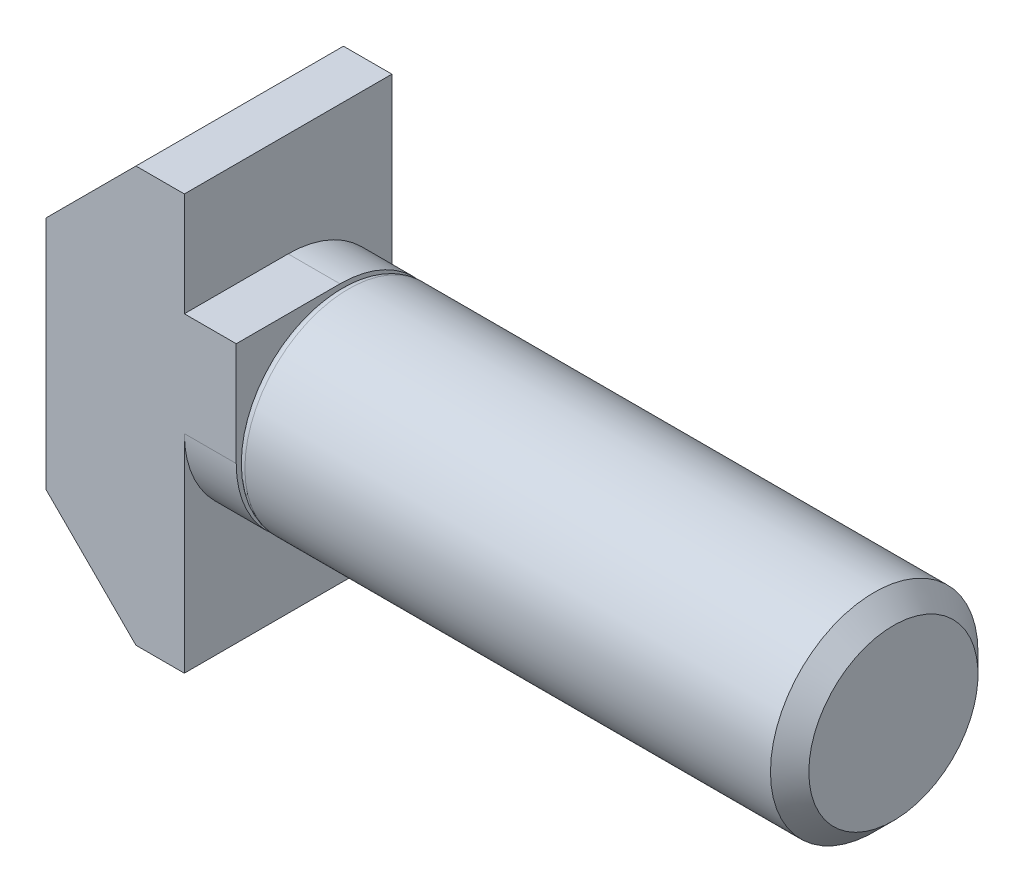
ISO-10303-21;
HEADER;
FILE_DESCRIPTION(('STEP AP214'),'2;1');
FILE_NAME('part.step','',(''),(''),'','','');
FILE_SCHEMA(('AUTOMOTIVE_DESIGN { 1 0 10303 214 1 1 1 1 }'));
ENDSEC;
DATA;
#1=APPLICATION_CONTEXT('core data for automotive mechanical design processes');
#2=APPLICATION_PROTOCOL_DEFINITION('international standard','automotive_design',2000,#1);
#3=PRODUCT_CONTEXT('',#1,'mechanical');
#4=PRODUCT('Part','Part','',(#3));
#5=PRODUCT_RELATED_PRODUCT_CATEGORY('part','',(#4));
#6=PRODUCT_DEFINITION_FORMATION('','',#4);
#7=PRODUCT_DEFINITION_CONTEXT('part definition',#1,'design');
#8=PRODUCT_DEFINITION('design','',#6,#7);
#9=PRODUCT_DEFINITION_SHAPE('','',#8);
#10=(LENGTH_UNIT() NAMED_UNIT(*) SI_UNIT(.MILLI.,.METRE.));
#11=(NAMED_UNIT(*) PLANE_ANGLE_UNIT() SI_UNIT($,.RADIAN.));
#12=(NAMED_UNIT(*) SI_UNIT($,.STERADIAN.) SOLID_ANGLE_UNIT());
#13=UNCERTAINTY_MEASURE_WITH_UNIT(LENGTH_MEASURE(1.E-05),#10,'distance_accuracy_value','');
#14=(GEOMETRIC_REPRESENTATION_CONTEXT(3) GLOBAL_UNCERTAINTY_ASSIGNED_CONTEXT((#13)) GLOBAL_UNIT_ASSIGNED_CONTEXT((#10,
#11,#12)) REPRESENTATION_CONTEXT('',''));
#15=CARTESIAN_POINT('',(0.,0.,0.));
#16=DIRECTION('',(0.,0.,1.));
#17=DIRECTION('',(1.,0.,0.));
#18=AXIS2_PLACEMENT_3D('',#15,#16,#17);
#19=CARTESIAN_POINT('',(-31.75,0.,0.));
#20=DIRECTION('',(-1.,0.,0.));
#21=DIRECTION('',(0.,0.,1.));
#22=AXIS2_PLACEMENT_3D('',#19,#20,#21);
#23=CYLINDRICAL_SURFACE('',#22,2.99999999999984);
#24=CARTESIAN_POINT('',(0.25,0.,0.));
#25=DIRECTION('',(-1.,0.,0.));
#26=DIRECTION('',(0.,0.,1.));
#27=AXIS2_PLACEMENT_3D('',#24,#25,#26);
#28=CIRCLE('',#27,2.99999999999984);
#29=CARTESIAN_POINT('',(0.25,0.,2.99999999999984));
#30=VERTEX_POINT('',#29);
#31=EDGE_CURVE('E167',#30,#30,#28,.F.);
#32=ORIENTED_EDGE('',*,*,#31,.T.);
#33=EDGE_LOOP('',(#32));
#34=FACE_BOUND('',#33,.T.);
#35=CARTESIAN_POINT('',(15.4454999999998,0.,0.));
#36=DIRECTION('',(-1.,0.,0.));
#37=DIRECTION('',(0.,0.,1.));
#38=AXIS2_PLACEMENT_3D('',#35,#36,#37);
#39=CIRCLE('',#38,2.99999999999982);
#40=CARTESIAN_POINT('',(15.4454999999998,0.,2.99999999999982));
#41=VERTEX_POINT('',#40);
#42=EDGE_CURVE('E153',#41,#41,#39,.T.);
#43=ORIENTED_EDGE('',*,*,#42,.T.);
#44=EDGE_LOOP('',(#43));
#45=FACE_BOUND('',#44,.T.);
#46=ADVANCED_FACE('F36',(#34,#45),#23,.T.);
#47=CARTESIAN_POINT('',(16.,0.,0.));
#48=DIRECTION('',(-1.,0.,0.));
#49=DIRECTION('',(0.,0.,1.));
#50=AXIS2_PLACEMENT_3D('',#47,#48,#49);
#51=CONICAL_SURFACE('',#50,2.4455,0.785398163397136);
#52=ORIENTED_EDGE('',*,*,#42,.F.);
#53=EDGE_LOOP('',(#52));
#54=FACE_BOUND('',#53,.T.);
#55=CARTESIAN_POINT('',(16.,0.,0.));
#56=DIRECTION('',(-1.,0.,0.));
#57=DIRECTION('',(0.,0.,1.));
#58=AXIS2_PLACEMENT_3D('',#55,#56,#57);
#59=CIRCLE('',#58,2.4455);
#60=CARTESIAN_POINT('',(16.,0.,2.4455));
#61=VERTEX_POINT('',#60);
#62=EDGE_CURVE('E149',#61,#61,#59,.T.);
#63=ORIENTED_EDGE('',*,*,#62,.T.);
#64=EDGE_LOOP('',(#63));
#65=FACE_BOUND('',#64,.T.);
#66=ADVANCED_FACE('F285',(#54,#65),#51,.T.);
#67=CARTESIAN_POINT('',(16.,2.4455,0.));
#68=DIRECTION('',(1.,0.,0.));
#69=DIRECTION('',(0.,0.,-1.));
#70=AXIS2_PLACEMENT_3D('',#67,#68,#69);
#71=PLANE('',#70);
#72=ORIENTED_EDGE('',*,*,#62,.F.);
#73=EDGE_LOOP('',(#72));
#74=FACE_BOUND('',#73,.T.);
#75=ADVANCED_FACE('F291',(#74),#71,.T.);
#76=CARTESIAN_POINT('',(0.25,0.,0.));
#77=DIRECTION('',(-1.,0.,0.));
#78=DIRECTION('',(0.,0.,1.));
#79=AXIS2_PLACEMENT_3D('',#76,#77,#78);
#80=TOROIDAL_SURFACE('',#79,2.74999999999984,0.25);
#81=ORIENTED_EDGE('',*,*,#31,.F.);
#82=EDGE_LOOP('',(#81));
#83=FACE_BOUND('',#82,.T.);
#84=CARTESIAN_POINT('',(0.,0.,0.));
#85=DIRECTION('',(-1.,0.,0.));
#86=DIRECTION('',(0.,0.,1.));
#87=AXIS2_PLACEMENT_3D('',#84,#85,#86);
#88=CIRCLE('',#87,2.74999999999984);
#89=CARTESIAN_POINT('',(0.,0.,2.74999999999984));
#90=VERTEX_POINT('',#89);
#91=EDGE_CURVE('E163',#90,#90,#88,.T.);
#92=ORIENTED_EDGE('',*,*,#91,.F.);
#93=EDGE_LOOP('',(#92));
#94=FACE_BOUND('',#93,.T.);
#95=ADVANCED_FACE('F297',(#83,#94),#80,.T.);
#96=CARTESIAN_POINT('',(-5.5,3.4,3.));
#97=DIRECTION('',(0.707106781186548,-0.707106781186547,0.));
#98=DIRECTION('',(0.707106781186547,0.707106781186548,0.));
#99=AXIS2_PLACEMENT_3D('',#96,#97,#98);
#100=PLANE('',#99);
#101=DIRECTION('',(-0.707106781186547,-0.707106781186548,0.));
#102=VECTOR('',#101,1.);
#103=CARTESIAN_POINT('',(-5.5,3.4,-3.));
#104=LINE('',#103,#102);
#105=CARTESIAN_POINT('',(-2.9,6.,-3.));
#106=VERTEX_POINT('',#105);
#107=CARTESIAN_POINT('',(-5.5,3.4,-3.));
#108=VERTEX_POINT('',#107);
#109=EDGE_CURVE('E148',#106,#108,#104,.T.);
#110=ORIENTED_EDGE('',*,*,#109,.T.);
#111=DIRECTION('',(0.,0.,-1.));
#112=VECTOR('',#111,1.);
#113=CARTESIAN_POINT('',(-5.5,3.4,3.));
#114=LINE('',#113,#112);
#115=CARTESIAN_POINT('',(-5.5,3.4,3.));
#116=VERTEX_POINT('',#115);
#117=EDGE_CURVE('E128',#116,#108,#114,.T.);
#118=ORIENTED_EDGE('',*,*,#117,.F.);
#119=DIRECTION('',(-0.707106781186547,-0.707106781186548,0.));
#120=VECTOR('',#119,1.);
#121=CARTESIAN_POINT('',(-5.5,3.4,3.));
#122=LINE('',#121,#120);
#123=CARTESIAN_POINT('',(-2.9,6.,3.));
#124=VERTEX_POINT('',#123);
#125=EDGE_CURVE('E135',#124,#116,#122,.T.);
#126=ORIENTED_EDGE('',*,*,#125,.F.);
#127=DIRECTION('',(0.,0.,-1.));
#128=VECTOR('',#127,1.);
#129=CARTESIAN_POINT('',(-2.9,6.,3.));
#130=LINE('',#129,#128);
#131=EDGE_CURVE('E217',#124,#106,#130,.T.);
#132=ORIENTED_EDGE('',*,*,#131,.T.);
#133=EDGE_LOOP('',(#110,#118,#126,#132));
#134=FACE_BOUND('',#133,.T.);
#135=ADVANCED_FACE('F146',(#134),#100,.F.);
#136=CARTESIAN_POINT('',(-5.5,-3.4,3.));
#137=DIRECTION('',(1.,0.,0.));
#138=DIRECTION('',(0.,0.,-1.));
#139=AXIS2_PLACEMENT_3D('',#136,#137,#138);
#140=PLANE('',#139);
#141=DIRECTION('',(0.,-1.,0.));
#142=VECTOR('',#141,1.);
#143=CARTESIAN_POINT('',(-5.5,-3.4,-3.));
#144=LINE('',#143,#142);
#145=CARTESIAN_POINT('',(-5.5,-3.4,-3.));
#146=VERTEX_POINT('',#145);
#147=EDGE_CURVE('E219',#108,#146,#144,.T.);
#148=ORIENTED_EDGE('',*,*,#147,.T.);
#149=DIRECTION('',(0.,0.,-1.));
#150=VECTOR('',#149,1.);
#151=CARTESIAN_POINT('',(-5.5,-3.4,3.));
#152=LINE('',#151,#150);
#153=CARTESIAN_POINT('',(-5.5,-3.4,3.));
#154=VERTEX_POINT('',#153);
#155=EDGE_CURVE('E131',#154,#146,#152,.T.);
#156=ORIENTED_EDGE('',*,*,#155,.F.);
#157=DIRECTION('',(0.,-1.,0.));
#158=VECTOR('',#157,1.);
#159=CARTESIAN_POINT('',(-5.5,-3.4,3.));
#160=LINE('',#159,#158);
#161=EDGE_CURVE('E124',#116,#154,#160,.T.);
#162=ORIENTED_EDGE('',*,*,#161,.F.);
#163=ORIENTED_EDGE('',*,*,#117,.T.);
#164=EDGE_LOOP('',(#148,#156,#162,#163));
#165=FACE_BOUND('',#164,.T.);
#166=ADVANCED_FACE('F126',(#165),#140,.F.);
#167=CARTESIAN_POINT('',(-5.5,-3.4,3.));
#168=DIRECTION('',(0.707106781186548,0.707106781186547,0.));
#169=DIRECTION('',(-0.707106781186547,0.707106781186548,0.));
#170=AXIS2_PLACEMENT_3D('',#167,#168,#169);
#171=PLANE('',#170);
#172=DIRECTION('',(0.707106781186547,-0.707106781186548,0.));
#173=VECTOR('',#172,1.);
#174=CARTESIAN_POINT('',(-5.5,-3.4,-3.));
#175=LINE('',#174,#173);
#176=CARTESIAN_POINT('',(-2.9,-6.,-3.));
#177=VERTEX_POINT('',#176);
#178=EDGE_CURVE('E221',#146,#177,#175,.T.);
#179=ORIENTED_EDGE('',*,*,#178,.T.);
#180=DIRECTION('',(0.,0.,-1.));
#181=VECTOR('',#180,1.);
#182=CARTESIAN_POINT('',(-2.9,-6.,3.));
#183=LINE('',#182,#181);
#184=CARTESIAN_POINT('',(-2.9,-6.,3.));
#185=VERTEX_POINT('',#184);
#186=EDGE_CURVE('E156',#185,#177,#183,.T.);
#187=ORIENTED_EDGE('',*,*,#186,.F.);
#188=DIRECTION('',(0.707106781186547,-0.707106781186548,0.));
#189=VECTOR('',#188,1.);
#190=CARTESIAN_POINT('',(-5.5,-3.4,3.));
#191=LINE('',#190,#189);
#192=EDGE_CURVE('E134',#154,#185,#191,.T.);
#193=ORIENTED_EDGE('',*,*,#192,.F.);
#194=ORIENTED_EDGE('',*,*,#155,.T.);
#195=EDGE_LOOP('',(#179,#187,#193,#194));
#196=FACE_BOUND('',#195,.T.);
#197=ADVANCED_FACE('F274',(#196),#171,.F.);
#198=CARTESIAN_POINT('',(-2.9,-6.,3.));
#199=DIRECTION('',(0.,1.,0.));
#200=DIRECTION('',(0.,0.,1.));
#201=AXIS2_PLACEMENT_3D('',#198,#199,#200);
#202=PLANE('',#201);
#203=DIRECTION('',(1.,0.,0.));
#204=VECTOR('',#203,1.);
#205=CARTESIAN_POINT('',(-2.9,-6.,-3.));
#206=LINE('',#205,#204);
#207=CARTESIAN_POINT('',(-1.5,-6.,-3.));
#208=VERTEX_POINT('',#207);
#209=EDGE_CURVE('E223',#177,#208,#206,.T.);
#210=ORIENTED_EDGE('',*,*,#209,.T.);
#211=DIRECTION('',(0.,0.,-1.));
#212=VECTOR('',#211,1.);
#213=CARTESIAN_POINT('',(-1.5,-6.,3.));
#214=LINE('',#213,#212);
#215=CARTESIAN_POINT('',(-1.5,-6.,3.));
#216=VERTEX_POINT('',#215);
#217=EDGE_CURVE('E248',#216,#208,#214,.T.);
#218=ORIENTED_EDGE('',*,*,#217,.F.);
#219=DIRECTION('',(1.,0.,0.));
#220=VECTOR('',#219,1.);
#221=CARTESIAN_POINT('',(-2.9,-6.,3.));
#222=LINE('',#221,#220);
#223=EDGE_CURVE('E211',#185,#216,#222,.T.);
#224=ORIENTED_EDGE('',*,*,#223,.F.);
#225=ORIENTED_EDGE('',*,*,#186,.T.);
#226=EDGE_LOOP('',(#210,#218,#224,#225));
#227=FACE_BOUND('',#226,.T.);
#228=ADVANCED_FACE('F254',(#227),#202,.F.);
#229=CARTESIAN_POINT('',(-1.5,-6.,3.));
#230=DIRECTION('',(-1.,0.,0.));
#231=DIRECTION('',(0.,-1.,0.));
#232=AXIS2_PLACEMENT_3D('',#229,#230,#231);
#233=PLANE('',#232);
#234=DIRECTION('',(0.,1.,0.));
#235=VECTOR('',#234,1.);
#236=CARTESIAN_POINT('',(-1.5,-6.,-3.));
#237=LINE('',#236,#235);
#238=CARTESIAN_POINT('',(-1.5,-3.,-3.));
#239=VERTEX_POINT('',#238);
#240=EDGE_CURVE('E225',#208,#239,#237,.T.);
#241=ORIENTED_EDGE('',*,*,#240,.T.);
#242=DIRECTION('',(0.,0.,-1.));
#243=VECTOR('',#242,1.);
#244=CARTESIAN_POINT('',(-1.5,-3.,3.));
#245=LINE('',#244,#243);
#246=CARTESIAN_POINT('',(-1.5,-3.,0.));
#247=VERTEX_POINT('',#246);
#248=EDGE_CURVE('E193',#247,#239,#245,.T.);
#249=ORIENTED_EDGE('',*,*,#248,.F.);
#250=CARTESIAN_POINT('',(-1.5,0.,0.));
#251=DIRECTION('',(-1.,0.,0.));
#252=DIRECTION('',(0.,-1.,0.));
#253=AXIS2_PLACEMENT_3D('',#250,#251,#252);
#254=CIRCLE('',#253,3.);
#255=CARTESIAN_POINT('',(-1.5,0.,3.));
#256=VERTEX_POINT('',#255);
#257=EDGE_CURVE('E44',#247,#256,#254,.T.);
#258=ORIENTED_EDGE('',*,*,#257,.T.);
#259=DIRECTION('',(0.,1.,0.));
#260=VECTOR('',#259,1.);
#261=CARTESIAN_POINT('',(-1.5,-6.,3.));
#262=LINE('',#261,#260);
#263=EDGE_CURVE('E192',#216,#256,#262,.T.);
#264=ORIENTED_EDGE('',*,*,#263,.F.);
#265=ORIENTED_EDGE('',*,*,#217,.T.);
#266=EDGE_LOOP('',(#241,#249,#258,#264,#265));
#267=FACE_BOUND('',#266,.T.);
#268=ADVANCED_FACE('F190',(#267),#233,.F.);
#269=CARTESIAN_POINT('',(-1.5,-3.,3.));
#270=DIRECTION('',(0.,1.,0.));
#271=DIRECTION('',(-1.,0.,0.));
#272=AXIS2_PLACEMENT_3D('',#269,#270,#271);
#273=PLANE('',#272);
#274=DIRECTION('',(0.,0.,-1.));
#275=VECTOR('',#274,1.);
#276=CARTESIAN_POINT('',(0.,-3.,3.));
#277=LINE('',#276,#275);
#278=CARTESIAN_POINT('',(0.,-3.,0.));
#279=VERTEX_POINT('',#278);
#280=CARTESIAN_POINT('',(0.,-3.,-3.));
#281=VERTEX_POINT('',#280);
#282=EDGE_CURVE('E245',#279,#281,#277,.T.);
#283=ORIENTED_EDGE('',*,*,#282,.F.);
#284=DIRECTION('',(1.,0.,0.));
#285=VECTOR('',#284,1.);
#286=CARTESIAN_POINT('',(-1.5,-3.,0.));
#287=LINE('',#286,#285);
#288=EDGE_CURVE('E178',#279,#247,#287,.F.);
#289=ORIENTED_EDGE('',*,*,#288,.T.);
#290=ORIENTED_EDGE('',*,*,#248,.T.);
#291=DIRECTION('',(1.,0.,0.));
#292=VECTOR('',#291,1.);
#293=CARTESIAN_POINT('',(-1.5,-3.,-3.));
#294=LINE('',#293,#292);
#295=EDGE_CURVE('E227',#239,#281,#294,.T.);
#296=ORIENTED_EDGE('',*,*,#295,.T.);
#297=EDGE_LOOP('',(#283,#289,#290,#296));
#298=FACE_BOUND('',#297,.T.);
#299=ADVANCED_FACE('F263',(#298),#273,.F.);
#300=CARTESIAN_POINT('',(0.,3.,3.));
#301=DIRECTION('',(-1.,0.,0.));
#302=DIRECTION('',(0.,0.,1.));
#303=AXIS2_PLACEMENT_3D('',#300,#301,#302);
#304=PLANE('',#303);
#305=ORIENTED_EDGE('',*,*,#91,.T.);
#306=EDGE_LOOP('',(#305));
#307=FACE_BOUND('',#306,.T.);
#308=DIRECTION('',(0.,1.,0.));
#309=VECTOR('',#308,1.);
#310=CARTESIAN_POINT('',(0.,3.,3.));
#311=LINE('',#310,#309);
#312=CARTESIAN_POINT('',(0.,0.,3.));
#313=VERTEX_POINT('',#312);
#314=CARTESIAN_POINT('',(0.,3.,3.));
#315=VERTEX_POINT('',#314);
#316=EDGE_CURVE('E198',#313,#315,#311,.T.);
#317=ORIENTED_EDGE('',*,*,#316,.F.);
#318=CARTESIAN_POINT('',(0.,0.,0.));
#319=DIRECTION('',(-1.,0.,0.));
#320=DIRECTION('',(0.,0.,1.));
#321=AXIS2_PLACEMENT_3D('',#318,#319,#320);
#322=CIRCLE('',#321,3.);
#323=EDGE_CURVE('E176',#313,#279,#322,.F.);
#324=ORIENTED_EDGE('',*,*,#323,.T.);
#325=ORIENTED_EDGE('',*,*,#282,.T.);
#326=DIRECTION('',(0.,1.,0.));
#327=VECTOR('',#326,1.);
#328=CARTESIAN_POINT('',(0.,3.,-3.));
#329=LINE('',#328,#327);
#330=CARTESIAN_POINT('',(0.,0.,-3.));
#331=VERTEX_POINT('',#330);
#332=EDGE_CURVE('E230',#281,#331,#329,.T.);
#333=ORIENTED_EDGE('',*,*,#332,.T.);
#334=CARTESIAN_POINT('',(0.,0.,0.));
#335=DIRECTION('',(-1.,0.,0.));
#336=DIRECTION('',(0.,0.,1.));
#337=AXIS2_PLACEMENT_3D('',#334,#335,#336);
#338=CIRCLE('',#337,3.);
#339=CARTESIAN_POINT('',(0.,3.,0.));
#340=VERTEX_POINT('',#339);
#341=EDGE_CURVE('E174',#331,#340,#338,.F.);
#342=ORIENTED_EDGE('',*,*,#341,.T.);
#343=DIRECTION('',(0.,0.,-1.));
#344=VECTOR('',#343,1.);
#345=CARTESIAN_POINT('',(0.,3.,3.));
#346=LINE('',#345,#344);
#347=EDGE_CURVE('E204',#315,#340,#346,.T.);
#348=ORIENTED_EDGE('',*,*,#347,.F.);
#349=EDGE_LOOP('',(#317,#324,#325,#333,#342,#348));
#350=FACE_BOUND('',#349,.T.);
#351=ADVANCED_FACE('F201',(#307,#350),#304,.F.);
#352=CARTESIAN_POINT('',(-1.5,3.,3.));
#353=DIRECTION('',(0.,-1.,0.));
#354=DIRECTION('',(1.,0.,0.));
#355=AXIS2_PLACEMENT_3D('',#352,#353,#354);
#356=PLANE('',#355);
#357=ORIENTED_EDGE('',*,*,#347,.T.);
#358=DIRECTION('',(-1.,0.,0.));
#359=VECTOR('',#358,1.);
#360=CARTESIAN_POINT('',(-1.5,3.,0.));
#361=LINE('',#360,#359);
#362=CARTESIAN_POINT('',(-1.5,3.,0.));
#363=VERTEX_POINT('',#362);
#364=EDGE_CURVE('E180',#340,#363,#361,.T.);
#365=ORIENTED_EDGE('',*,*,#364,.T.);
#366=DIRECTION('',(0.,0.,-1.));
#367=VECTOR('',#366,1.);
#368=CARTESIAN_POINT('',(-1.5,3.,3.));
#369=LINE('',#368,#367);
#370=CARTESIAN_POINT('',(-1.5,3.,3.));
#371=VERTEX_POINT('',#370);
#372=EDGE_CURVE('E241',#371,#363,#369,.T.);
#373=ORIENTED_EDGE('',*,*,#372,.F.);
#374=DIRECTION('',(-1.,0.,0.));
#375=VECTOR('',#374,1.);
#376=CARTESIAN_POINT('',(-1.5,3.,3.));
#377=LINE('',#376,#375);
#378=EDGE_CURVE('E206',#315,#371,#377,.T.);
#379=ORIENTED_EDGE('',*,*,#378,.F.);
#380=EDGE_LOOP('',(#357,#365,#373,#379));
#381=FACE_BOUND('',#380,.T.);
#382=ADVANCED_FACE('F267',(#381),#356,.F.);
#383=CARTESIAN_POINT('',(-1.5,6.,3.));
#384=DIRECTION('',(-1.,0.,0.));
#385=DIRECTION('',(0.,-1.,0.));
#386=AXIS2_PLACEMENT_3D('',#383,#384,#385);
#387=PLANE('',#386);
#388=DIRECTION('',(0.,1.,0.));
#389=VECTOR('',#388,1.);
#390=CARTESIAN_POINT('',(-1.5,6.,-3.));
#391=LINE('',#390,#389);
#392=CARTESIAN_POINT('',(-1.5,0.,-3.));
#393=VERTEX_POINT('',#392);
#394=CARTESIAN_POINT('',(-1.5,6.,-3.));
#395=VERTEX_POINT('',#394);
#396=EDGE_CURVE('E51',#393,#395,#391,.T.);
#397=ORIENTED_EDGE('',*,*,#396,.T.);
#398=DIRECTION('',(0.,0.,-1.));
#399=VECTOR('',#398,1.);
#400=CARTESIAN_POINT('',(-1.5,6.,3.));
#401=LINE('',#400,#399);
#402=CARTESIAN_POINT('',(-1.5,6.,3.));
#403=VERTEX_POINT('',#402);
#404=EDGE_CURVE('E237',#403,#395,#401,.T.);
#405=ORIENTED_EDGE('',*,*,#404,.F.);
#406=DIRECTION('',(0.,1.,0.));
#407=VECTOR('',#406,1.);
#408=CARTESIAN_POINT('',(-1.5,6.,3.));
#409=LINE('',#408,#407);
#410=EDGE_CURVE('E208',#371,#403,#409,.T.);
#411=ORIENTED_EDGE('',*,*,#410,.F.);
#412=ORIENTED_EDGE('',*,*,#372,.T.);
#413=CARTESIAN_POINT('',(-1.5,0.,0.));
#414=DIRECTION('',(-1.,0.,0.));
#415=DIRECTION('',(0.,-1.,0.));
#416=AXIS2_PLACEMENT_3D('',#413,#414,#415);
#417=CIRCLE('',#416,3.);
#418=EDGE_CURVE('E11',#363,#393,#417,.T.);
#419=ORIENTED_EDGE('',*,*,#418,.T.);
#420=EDGE_LOOP('',(#397,#405,#411,#412,#419));
#421=FACE_BOUND('',#420,.T.);
#422=ADVANCED_FACE('F270',(#421),#387,.F.);
#423=CARTESIAN_POINT('',(-2.9,6.,3.));
#424=DIRECTION('',(0.,-1.,0.));
#425=DIRECTION('',(0.,0.,-1.));
#426=AXIS2_PLACEMENT_3D('',#423,#424,#425);
#427=PLANE('',#426);
#428=DIRECTION('',(-1.,0.,0.));
#429=VECTOR('',#428,1.);
#430=CARTESIAN_POINT('',(-2.9,6.,-3.));
#431=LINE('',#430,#429);
#432=EDGE_CURVE('E144',#395,#106,#431,.T.);
#433=ORIENTED_EDGE('',*,*,#432,.T.);
#434=ORIENTED_EDGE('',*,*,#131,.F.);
#435=DIRECTION('',(-1.,0.,0.));
#436=VECTOR('',#435,1.);
#437=CARTESIAN_POINT('',(-2.9,6.,3.));
#438=LINE('',#437,#436);
#439=EDGE_CURVE('E140',#403,#124,#438,.T.);
#440=ORIENTED_EDGE('',*,*,#439,.F.);
#441=ORIENTED_EDGE('',*,*,#404,.T.);
#442=EDGE_LOOP('',(#433,#434,#440,#441));
#443=FACE_BOUND('',#442,.T.);
#444=ADVANCED_FACE('F273',(#443),#427,.F.);
#445=CARTESIAN_POINT('',(0.,0.,3.));
#446=DIRECTION('',(0.,0.,-1.));
#447=DIRECTION('',(-1.,0.,0.));
#448=AXIS2_PLACEMENT_3D('',#445,#446,#447);
#449=PLANE('',#448);
#450=ORIENTED_EDGE('',*,*,#263,.T.);
#451=DIRECTION('',(1.,0.,0.));
#452=VECTOR('',#451,1.);
#453=CARTESIAN_POINT('',(0.,0.,3.));
#454=LINE('',#453,#452);
#455=EDGE_CURVE('E171',#256,#313,#454,.T.);
#456=ORIENTED_EDGE('',*,*,#455,.T.);
#457=ORIENTED_EDGE('',*,*,#316,.T.);
#458=ORIENTED_EDGE('',*,*,#378,.T.);
#459=ORIENTED_EDGE('',*,*,#410,.T.);
#460=ORIENTED_EDGE('',*,*,#439,.T.);
#461=ORIENTED_EDGE('',*,*,#125,.T.);
#462=ORIENTED_EDGE('',*,*,#161,.T.);
#463=ORIENTED_EDGE('',*,*,#192,.T.);
#464=ORIENTED_EDGE('',*,*,#223,.T.);
#465=EDGE_LOOP('',(#450,#456,#457,#458,#459,#460,#461,#462,#463,#464));
#466=FACE_BOUND('',#465,.T.);
#467=ADVANCED_FACE('F138',(#466),#449,.F.);
#468=CARTESIAN_POINT('',(0.,0.,-3.));
#469=DIRECTION('',(0.,0.,-1.));
#470=DIRECTION('',(-1.,0.,0.));
#471=AXIS2_PLACEMENT_3D('',#468,#469,#470);
#472=PLANE('',#471);
#473=ORIENTED_EDGE('',*,*,#396,.F.);
#474=DIRECTION('',(-1.,0.,0.));
#475=VECTOR('',#474,1.);
#476=CARTESIAN_POINT('',(0.,0.,-3.));
#477=LINE('',#476,#475);
#478=EDGE_CURVE('E182',#393,#331,#477,.F.);
#479=ORIENTED_EDGE('',*,*,#478,.T.);
#480=ORIENTED_EDGE('',*,*,#332,.F.);
#481=ORIENTED_EDGE('',*,*,#295,.F.);
#482=ORIENTED_EDGE('',*,*,#240,.F.);
#483=ORIENTED_EDGE('',*,*,#209,.F.);
#484=ORIENTED_EDGE('',*,*,#178,.F.);
#485=ORIENTED_EDGE('',*,*,#147,.F.);
#486=ORIENTED_EDGE('',*,*,#109,.F.);
#487=ORIENTED_EDGE('',*,*,#432,.F.);
#488=EDGE_LOOP('',(#473,#479,#480,#481,#482,#483,#484,#485,#486,#487));
#489=FACE_BOUND('',#488,.T.);
#490=ADVANCED_FACE('F259',(#489),#472,.T.);
#491=CARTESIAN_POINT('',(0.,0.,0.));
#492=DIRECTION('',(1.,0.,0.));
#493=DIRECTION('',(0.,1.,0.));
#494=AXIS2_PLACEMENT_3D('',#491,#492,#493);
#495=CYLINDRICAL_SURFACE('',#494,3.);
#496=ORIENTED_EDGE('',*,*,#257,.F.);
#497=ORIENTED_EDGE('',*,*,#288,.F.);
#498=ORIENTED_EDGE('',*,*,#323,.F.);
#499=ORIENTED_EDGE('',*,*,#455,.F.);
#500=EDGE_LOOP('',(#496,#497,#498,#499));
#501=FACE_BOUND('',#500,.T.);
#502=ADVANCED_FACE('F196',(#501),#495,.T.);
#503=CARTESIAN_POINT('',(-1.5,0.,0.));
#504=DIRECTION('',(1.,0.,0.));
#505=DIRECTION('',(0.,1.,0.));
#506=AXIS2_PLACEMENT_3D('',#503,#504,#505);
#507=CYLINDRICAL_SURFACE('',#506,3.);
#508=ORIENTED_EDGE('',*,*,#341,.F.);
#509=ORIENTED_EDGE('',*,*,#478,.F.);
#510=ORIENTED_EDGE('',*,*,#418,.F.);
#511=ORIENTED_EDGE('',*,*,#364,.F.);
#512=EDGE_LOOP('',(#508,#509,#510,#511));
#513=FACE_BOUND('',#512,.T.);
#514=ADVANCED_FACE('F38',(#513),#507,.T.);
#515=CLOSED_SHELL('',(#46,#66,#75,#95,#135,#166,#197,#228,#268,#299,#351,#382,#422,#444,#467,
#490,#502,#514));
#516=MANIFOLD_SOLID_BREP('B2',#515);
#517=ADVANCED_BREP_SHAPE_REPRESENTATION('',(#18,#516),#14);
#518=SHAPE_DEFINITION_REPRESENTATION(#9,#517);
ENDSEC;
END-ISO-10303-21;
